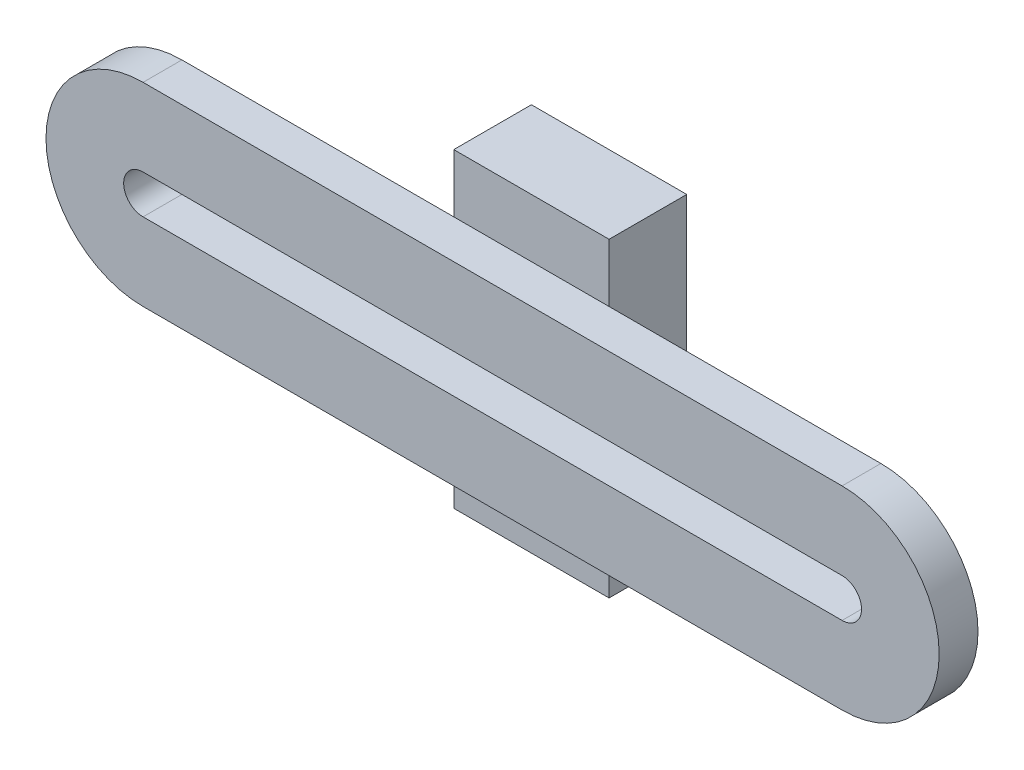
ISO-10303-21;
HEADER;
FILE_DESCRIPTION(('STEP AP214'),'2;1');
FILE_NAME('part.step','',(''),(''),'','','');
FILE_SCHEMA(('AUTOMOTIVE_DESIGN { 1 0 10303 214 1 1 1 1 }'));
ENDSEC;
DATA;
#1=APPLICATION_CONTEXT('core data for automotive mechanical design processes');
#2=APPLICATION_PROTOCOL_DEFINITION('international standard','automotive_design',2000,#1);
#3=PRODUCT_CONTEXT('',#1,'mechanical');
#4=PRODUCT('Part','Part','',(#3));
#5=PRODUCT_RELATED_PRODUCT_CATEGORY('part','',(#4));
#6=PRODUCT_DEFINITION_FORMATION('','',#4);
#7=PRODUCT_DEFINITION_CONTEXT('part definition',#1,'design');
#8=PRODUCT_DEFINITION('design','',#6,#7);
#9=PRODUCT_DEFINITION_SHAPE('','',#8);
#10=(LENGTH_UNIT() NAMED_UNIT(*) SI_UNIT(.MILLI.,.METRE.));
#11=(NAMED_UNIT(*) PLANE_ANGLE_UNIT() SI_UNIT($,.RADIAN.));
#12=(NAMED_UNIT(*) SI_UNIT($,.STERADIAN.) SOLID_ANGLE_UNIT());
#13=UNCERTAINTY_MEASURE_WITH_UNIT(LENGTH_MEASURE(1.E-05),#10,'distance_accuracy_value','');
#14=(GEOMETRIC_REPRESENTATION_CONTEXT(3) GLOBAL_UNCERTAINTY_ASSIGNED_CONTEXT((#13)) GLOBAL_UNIT_ASSIGNED_CONTEXT((#10,
#11,#12)) REPRESENTATION_CONTEXT('',''));
#15=CARTESIAN_POINT('',(0.,0.,0.));
#16=DIRECTION('',(0.,0.,1.));
#17=DIRECTION('',(1.,0.,0.));
#18=AXIS2_PLACEMENT_3D('',#15,#16,#17);
#19=CARTESIAN_POINT('',(0.,0.,0.));
#20=DIRECTION('',(0.,0.,-1.));
#21=DIRECTION('',(-1.,0.,0.));
#22=AXIS2_PLACEMENT_3D('',#19,#20,#21);
#23=PLANE('',#22);
#24=DIRECTION('',(-1.,0.,0.));
#25=VECTOR('',#24,1.);
#26=CARTESIAN_POINT('',(-57.1499999999995,-45.3307191163703,0.));
#27=LINE('',#26,#25);
#28=CARTESIAN_POINT('',(12.6999999999999,-45.3307191163703,0.));
#29=VERTEX_POINT('',#28);
#30=CARTESIAN_POINT('',(-12.6999999999999,-45.3307191163703,0.));
#31=VERTEX_POINT('',#30);
#32=EDGE_CURVE('E11',#29,#31,#27,.T.);
#33=ORIENTED_EDGE('',*,*,#32,.F.);
#34=DIRECTION('',(0.,1.,0.));
#35=VECTOR('',#34,1.);
#36=CARTESIAN_POINT('',(12.6999999999999,-86.6057191163703,0.));
#37=LINE('',#36,#35);
#38=CARTESIAN_POINT('',(12.6999999999999,-35.8057191163703,0.));
#39=VERTEX_POINT('',#38);
#40=EDGE_CURVE('E256',#29,#39,#37,.T.);
#41=ORIENTED_EDGE('',*,*,#40,.T.);
#42=DIRECTION('',(-1.,0.,0.));
#43=VECTOR('',#42,1.);
#44=CARTESIAN_POINT('',(-12.6999999999999,-35.8057191163703,0.));
#45=LINE('',#44,#43);
#46=CARTESIAN_POINT('',(-12.6999999999999,-35.8057191163703,0.));
#47=VERTEX_POINT('',#46);
#48=EDGE_CURVE('E249',#39,#47,#45,.T.);
#49=ORIENTED_EDGE('',*,*,#48,.T.);
#50=DIRECTION('',(0.,-1.,0.));
#51=VECTOR('',#50,1.);
#52=CARTESIAN_POINT('',(-12.6999999999999,-86.6057191163703,0.));
#53=LINE('',#52,#51);
#54=EDGE_CURVE('E244',#47,#31,#53,.T.);
#55=ORIENTED_EDGE('',*,*,#54,.T.);
#56=EDGE_LOOP('',(#33,#41,#49,#55));
#57=FACE_BOUND('',#56,.T.);
#58=ADVANCED_FACE('F34',(#57),#23,.F.);
#59=DIRECTION('',(1.,0.,0.));
#60=VECTOR('',#59,1.);
#61=CARTESIAN_POINT('',(-57.1499999999995,-77.0807191163703,0.));
#62=LINE('',#61,#60);
#63=CARTESIAN_POINT('',(-12.6999999999999,-77.0807191163703,0.));
#64=VERTEX_POINT('',#63);
#65=CARTESIAN_POINT('',(12.6999999999999,-77.0807191163703,0.));
#66=VERTEX_POINT('',#65);
#67=EDGE_CURVE('E43',#64,#66,#62,.T.);
#68=ORIENTED_EDGE('',*,*,#67,.F.);
#69=CARTESIAN_POINT('',(-12.6999999999999,-86.6057191163703,0.));
#70=VERTEX_POINT('',#69);
#71=EDGE_CURVE('E248',#64,#70,#53,.T.);
#72=ORIENTED_EDGE('',*,*,#71,.T.);
#73=DIRECTION('',(1.,0.,0.));
#74=VECTOR('',#73,1.);
#75=CARTESIAN_POINT('',(-12.6999999999999,-86.6057191163703,0.));
#76=LINE('',#75,#74);
#77=CARTESIAN_POINT('',(12.6999999999999,-86.6057191163703,0.));
#78=VERTEX_POINT('',#77);
#79=EDGE_CURVE('E240',#70,#78,#76,.T.);
#80=ORIENTED_EDGE('',*,*,#79,.T.);
#81=EDGE_CURVE('E252',#78,#66,#37,.T.);
#82=ORIENTED_EDGE('',*,*,#81,.T.);
#83=EDGE_LOOP('',(#68,#72,#80,#82));
#84=FACE_BOUND('',#83,.T.);
#85=ADVANCED_FACE('F342',(#84),#23,.F.);
#86=CARTESIAN_POINT('',(-12.6999999999999,-58.0307191163703,0.));
#87=VERTEX_POINT('',#86);
#88=CARTESIAN_POINT('',(-12.6999999999999,-64.3807191163703,0.));
#89=VERTEX_POINT('',#88);
#90=EDGE_CURVE('E300',#87,#89,#53,.T.);
#91=ORIENTED_EDGE('',*,*,#90,.T.);
#92=DIRECTION('',(1.,0.,0.));
#93=VECTOR('',#92,1.);
#94=CARTESIAN_POINT('',(-57.1499999999995,-64.3807191163703,0.));
#95=LINE('',#94,#93);
#96=CARTESIAN_POINT('',(-5.4992613140312,-64.3807191163703,0.));
#97=VERTEX_POINT('',#96);
#98=EDGE_CURVE('E299',#89,#97,#95,.T.);
#99=ORIENTED_EDGE('',*,*,#98,.T.);
#100=CARTESIAN_POINT('',(0.,-61.2057191163703,0.));
#101=DIRECTION('',(0.,0.,1.));
#102=DIRECTION('',(1.,0.,0.));
#103=AXIS2_PLACEMENT_3D('',#100,#101,#102);
#104=CIRCLE('',#103,6.35);
#105=CARTESIAN_POINT('',(-5.49926131403118,-58.0307191163703,0.));
#106=VERTEX_POINT('',#105);
#107=EDGE_CURVE('E260',#106,#97,#104,.T.);
#108=ORIENTED_EDGE('',*,*,#107,.F.);
#109=DIRECTION('',(-1.,0.,0.));
#110=VECTOR('',#109,1.);
#111=CARTESIAN_POINT('',(-57.1499999999995,-58.0307191163703,0.));
#112=LINE('',#111,#110);
#113=EDGE_CURVE('E204',#106,#87,#112,.T.);
#114=ORIENTED_EDGE('',*,*,#113,.T.);
#115=EDGE_LOOP('',(#91,#99,#108,#114));
#116=FACE_BOUND('',#115,.T.);
#117=ADVANCED_FACE('F297',(#116),#23,.F.);
#118=CARTESIAN_POINT('',(12.6999999999999,-86.6057191163703,-69.4961266284946));
#119=DIRECTION('',(1.,0.,0.));
#120=DIRECTION('',(0.,0.,-1.));
#121=AXIS2_PLACEMENT_3D('',#118,#119,#120);
#122=PLANE('',#121);
#123=DIRECTION('',(0.,0.,1.));
#124=VECTOR('',#123,1.);
#125=CARTESIAN_POINT('',(12.6999999999999,-86.6057191163703,-69.4961266284946));
#126=LINE('',#125,#124);
#127=CARTESIAN_POINT('',(12.6999999999999,-86.6057191163703,-12.7));
#128=VERTEX_POINT('',#127);
#129=EDGE_CURVE('E274',#128,#78,#126,.T.);
#130=ORIENTED_EDGE('',*,*,#129,.F.);
#131=DIRECTION('',(0.,1.,0.));
#132=VECTOR('',#131,1.);
#133=CARTESIAN_POINT('',(12.6999999999999,-86.6057191163703,-12.7));
#134=LINE('',#133,#132);
#135=CARTESIAN_POINT('',(12.6999999999999,-35.8057191163703,-12.7));
#136=VERTEX_POINT('',#135);
#137=EDGE_CURVE('E239',#128,#136,#134,.T.);
#138=ORIENTED_EDGE('',*,*,#137,.T.);
#139=DIRECTION('',(0.,0.,1.));
#140=VECTOR('',#139,1.);
#141=CARTESIAN_POINT('',(12.6999999999999,-35.8057191163703,-69.4961266284946));
#142=LINE('',#141,#140);
#143=EDGE_CURVE('E38',#136,#39,#142,.T.);
#144=ORIENTED_EDGE('',*,*,#143,.T.);
#145=ORIENTED_EDGE('',*,*,#40,.F.);
#146=CARTESIAN_POINT('',(12.6999999999999,-58.0307191163703,0.));
#147=VERTEX_POINT('',#146);
#148=EDGE_CURVE('E319',#147,#29,#37,.T.);
#149=ORIENTED_EDGE('',*,*,#148,.F.);
#150=CARTESIAN_POINT('',(12.6999999999999,-64.3807191163703,0.));
#151=VERTEX_POINT('',#150);
#152=EDGE_CURVE('E326',#151,#147,#37,.T.);
#153=ORIENTED_EDGE('',*,*,#152,.F.);
#154=EDGE_CURVE('E255',#66,#151,#37,.T.);
#155=ORIENTED_EDGE('',*,*,#154,.F.);
#156=ORIENTED_EDGE('',*,*,#81,.F.);
#157=EDGE_LOOP('',(#130,#138,#144,#145,#149,#153,#155,#156));
#158=FACE_BOUND('',#157,.T.);
#159=ADVANCED_FACE('F325',(#158),#122,.T.);
#160=CARTESIAN_POINT('',(-12.6999999999999,-86.6057191163703,-69.4961266284946));
#161=DIRECTION('',(0.,-1.,0.));
#162=DIRECTION('',(0.,0.,-1.));
#163=AXIS2_PLACEMENT_3D('',#160,#161,#162);
#164=PLANE('',#163);
#165=DIRECTION('',(0.,0.,1.));
#166=VECTOR('',#165,1.);
#167=CARTESIAN_POINT('',(-12.6999999999999,-86.6057191163703,-69.4961266284946));
#168=LINE('',#167,#166);
#169=CARTESIAN_POINT('',(-12.6999999999999,-86.6057191163703,-12.7));
#170=VERTEX_POINT('',#169);
#171=EDGE_CURVE('E268',#170,#70,#168,.T.);
#172=ORIENTED_EDGE('',*,*,#171,.F.);
#173=DIRECTION('',(1.,0.,0.));
#174=VECTOR('',#173,1.);
#175=CARTESIAN_POINT('',(-12.6999999999999,-86.6057191163703,-12.7));
#176=LINE('',#175,#174);
#177=EDGE_CURVE('E271',#170,#128,#176,.T.);
#178=ORIENTED_EDGE('',*,*,#177,.T.);
#179=ORIENTED_EDGE('',*,*,#129,.T.);
#180=ORIENTED_EDGE('',*,*,#79,.F.);
#181=EDGE_LOOP('',(#172,#178,#179,#180));
#182=FACE_BOUND('',#181,.T.);
#183=ADVANCED_FACE('F347',(#182),#164,.T.);
#184=CARTESIAN_POINT('',(-12.6999999999999,-86.6057191163703,-69.4961266284946));
#185=DIRECTION('',(-1.,0.,0.));
#186=DIRECTION('',(0.,0.,1.));
#187=AXIS2_PLACEMENT_3D('',#184,#185,#186);
#188=PLANE('',#187);
#189=DIRECTION('',(0.,0.,1.));
#190=VECTOR('',#189,1.);
#191=CARTESIAN_POINT('',(-12.6999999999999,-35.8057191163703,-69.4961266284946));
#192=LINE('',#191,#190);
#193=CARTESIAN_POINT('',(-12.6999999999999,-35.8057191163703,-12.7));
#194=VERTEX_POINT('',#193);
#195=EDGE_CURVE('E267',#194,#47,#192,.T.);
#196=ORIENTED_EDGE('',*,*,#195,.F.);
#197=DIRECTION('',(0.,-1.,0.));
#198=VECTOR('',#197,1.);
#199=CARTESIAN_POINT('',(-12.6999999999999,-86.6057191163703,-12.7));
#200=LINE('',#199,#198);
#201=EDGE_CURVE('E275',#194,#170,#200,.T.);
#202=ORIENTED_EDGE('',*,*,#201,.T.);
#203=ORIENTED_EDGE('',*,*,#171,.T.);
#204=ORIENTED_EDGE('',*,*,#71,.F.);
#205=EDGE_CURVE('E337',#89,#64,#53,.T.);
#206=ORIENTED_EDGE('',*,*,#205,.F.);
#207=ORIENTED_EDGE('',*,*,#90,.F.);
#208=EDGE_CURVE('E247',#31,#87,#53,.T.);
#209=ORIENTED_EDGE('',*,*,#208,.F.);
#210=ORIENTED_EDGE('',*,*,#54,.F.);
#211=EDGE_LOOP('',(#196,#202,#203,#204,#206,#207,#209,#210));
#212=FACE_BOUND('',#211,.T.);
#213=ADVANCED_FACE('F345',(#212),#188,.T.);
#214=CARTESIAN_POINT('',(-12.6999999999999,-35.8057191163703,-69.4961266284946));
#215=DIRECTION('',(0.,1.,0.));
#216=DIRECTION('',(0.,0.,1.));
#217=AXIS2_PLACEMENT_3D('',#214,#215,#216);
#218=PLANE('',#217);
#219=ORIENTED_EDGE('',*,*,#143,.F.);
#220=DIRECTION('',(-1.,0.,0.));
#221=VECTOR('',#220,1.);
#222=CARTESIAN_POINT('',(-12.6999999999999,-35.8057191163703,-12.7));
#223=LINE('',#222,#221);
#224=EDGE_CURVE('E264',#136,#194,#223,.T.);
#225=ORIENTED_EDGE('',*,*,#224,.T.);
#226=ORIENTED_EDGE('',*,*,#195,.T.);
#227=ORIENTED_EDGE('',*,*,#48,.F.);
#228=EDGE_LOOP('',(#219,#225,#226,#227));
#229=FACE_BOUND('',#228,.T.);
#230=ADVANCED_FACE('F351',(#229),#218,.T.);
#231=CARTESIAN_POINT('',(0.,-61.2057191163703,-69.4961266284946));
#232=DIRECTION('',(0.,0.,1.));
#233=DIRECTION('',(1.,0.,0.));
#234=AXIS2_PLACEMENT_3D('',#231,#232,#233);
#235=CYLINDRICAL_SURFACE('',#234,6.35);
#236=CARTESIAN_POINT('',(5.49926131403118,-58.0307191163703,0.));
#237=VERTEX_POINT('',#236);
#238=EDGE_CURVE('E257',#237,#106,#104,.T.);
#239=ORIENTED_EDGE('',*,*,#238,.T.);
#240=ORIENTED_EDGE('',*,*,#107,.T.);
#241=CARTESIAN_POINT('',(5.4992613140312,-64.3807191163703,0.));
#242=VERTEX_POINT('',#241);
#243=EDGE_CURVE('E285',#97,#242,#104,.T.);
#244=ORIENTED_EDGE('',*,*,#243,.T.);
#245=EDGE_CURVE('E261',#242,#237,#104,.T.);
#246=ORIENTED_EDGE('',*,*,#245,.T.);
#247=EDGE_LOOP('',(#239,#240,#244,#246));
#248=FACE_BOUND('',#247,.T.);
#249=CARTESIAN_POINT('',(0.,-61.2057191163703,-12.7));
#250=DIRECTION('',(0.,0.,-1.));
#251=DIRECTION('',(-1.,0.,0.));
#252=AXIS2_PLACEMENT_3D('',#249,#250,#251);
#253=CIRCLE('',#252,6.35);
#254=CARTESIAN_POINT('',(-6.35,-61.2057191163703,-12.7));
#255=VERTEX_POINT('',#254);
#256=EDGE_CURVE('E243',#255,#255,#253,.F.);
#257=ORIENTED_EDGE('',*,*,#256,.F.);
#258=EDGE_LOOP('',(#257));
#259=FACE_BOUND('',#258,.T.);
#260=ADVANCED_FACE('F291',(#248,#259),#235,.F.);
#261=ORIENTED_EDGE('',*,*,#245,.F.);
#262=EDGE_CURVE('E198',#242,#151,#95,.T.);
#263=ORIENTED_EDGE('',*,*,#262,.T.);
#264=ORIENTED_EDGE('',*,*,#152,.T.);
#265=EDGE_CURVE('E304',#147,#237,#112,.T.);
#266=ORIENTED_EDGE('',*,*,#265,.T.);
#267=EDGE_LOOP('',(#261,#263,#264,#266));
#268=FACE_BOUND('',#267,.T.);
#269=ADVANCED_FACE('F329',(#268),#23,.F.);
#270=CARTESIAN_POINT('',(0.,-1.22124532708767E-12,-12.7));
#271=DIRECTION('',(0.,0.,-1.));
#272=DIRECTION('',(-1.,0.,0.));
#273=AXIS2_PLACEMENT_3D('',#270,#271,#272);
#274=PLANE('',#273);
#275=ORIENTED_EDGE('',*,*,#137,.F.);
#276=ORIENTED_EDGE('',*,*,#177,.F.);
#277=ORIENTED_EDGE('',*,*,#201,.F.);
#278=ORIENTED_EDGE('',*,*,#224,.F.);
#279=EDGE_LOOP('',(#275,#276,#277,#278));
#280=FACE_BOUND('',#279,.T.);
#281=ORIENTED_EDGE('',*,*,#256,.T.);
#282=EDGE_LOOP('',(#281));
#283=FACE_BOUND('',#282,.T.);
#284=ADVANCED_FACE('F36',(#280,#283),#274,.T.);
#285=CARTESIAN_POINT('',(-57.15,-61.2057191163703,0.));
#286=DIRECTION('',(0.,0.,1.));
#287=DIRECTION('',(1.,0.,0.));
#288=AXIS2_PLACEMENT_3D('',#285,#286,#287);
#289=PLANE('',#288);
#290=CARTESIAN_POINT('',(57.1499999999995,-77.0807191163703,0.));
#291=VERTEX_POINT('',#290);
#292=EDGE_CURVE('E221',#66,#291,#62,.T.);
#293=ORIENTED_EDGE('',*,*,#292,.F.);
#294=ORIENTED_EDGE('',*,*,#154,.T.);
#295=CARTESIAN_POINT('',(57.1499999999995,-64.3807191163703,0.));
#296=VERTEX_POINT('',#295);
#297=EDGE_CURVE('E61',#151,#296,#95,.T.);
#298=ORIENTED_EDGE('',*,*,#297,.T.);
#299=CARTESIAN_POINT('',(57.15,-61.2057191163703,0.));
#300=DIRECTION('',(0.,0.,1.));
#301=DIRECTION('',(1.,0.,0.));
#302=AXIS2_PLACEMENT_3D('',#299,#300,#301);
#303=CIRCLE('',#302,3.175);
#304=CARTESIAN_POINT('',(57.1499999999995,-58.0307191163703,0.));
#305=VERTEX_POINT('',#304);
#306=EDGE_CURVE('E196',#296,#305,#303,.T.);
#307=ORIENTED_EDGE('',*,*,#306,.T.);
#308=EDGE_CURVE('E175',#305,#147,#112,.T.);
#309=ORIENTED_EDGE('',*,*,#308,.T.);
#310=ORIENTED_EDGE('',*,*,#148,.T.);
#311=CARTESIAN_POINT('',(57.1499999999995,-45.3307191163703,0.));
#312=VERTEX_POINT('',#311);
#313=EDGE_CURVE('E45',#312,#29,#27,.T.);
#314=ORIENTED_EDGE('',*,*,#313,.F.);
#315=CARTESIAN_POINT('',(57.15,-61.2057191163703,0.));
#316=DIRECTION('',(0.,0.,1.));
#317=DIRECTION('',(1.,0.,0.));
#318=AXIS2_PLACEMENT_3D('',#315,#316,#317);
#319=CIRCLE('',#318,15.875);
#320=EDGE_CURVE('E225',#291,#312,#319,.T.);
#321=ORIENTED_EDGE('',*,*,#320,.F.);
#322=EDGE_LOOP('',(#293,#294,#298,#307,#309,#310,#314,#321));
#323=FACE_BOUND('',#322,.T.);
#324=ADVANCED_FACE('F308',(#323),#289,.F.);
#325=ORIENTED_EDGE('',*,*,#243,.F.);
#326=EDGE_CURVE('E197',#97,#242,#95,.T.);
#327=ORIENTED_EDGE('',*,*,#326,.T.);
#328=EDGE_LOOP('',(#325,#327));
#329=FACE_BOUND('',#328,.T.);
#330=ADVANCED_FACE('F379',(#329),#289,.F.);
#331=CARTESIAN_POINT('',(-57.1499999999995,-45.3307191163703,0.));
#332=VERTEX_POINT('',#331);
#333=EDGE_CURVE('E46',#31,#332,#27,.T.);
#334=ORIENTED_EDGE('',*,*,#333,.F.);
#335=ORIENTED_EDGE('',*,*,#208,.T.);
#336=CARTESIAN_POINT('',(-57.1499999999995,-58.0307191163703,0.));
#337=VERTEX_POINT('',#336);
#338=EDGE_CURVE('E53',#87,#337,#112,.T.);
#339=ORIENTED_EDGE('',*,*,#338,.T.);
#340=CARTESIAN_POINT('',(-57.15,-61.2057191163703,0.));
#341=DIRECTION('',(0.,0.,1.));
#342=DIRECTION('',(1.,0.,0.));
#343=AXIS2_PLACEMENT_3D('',#340,#341,#342);
#344=CIRCLE('',#343,3.175);
#345=CARTESIAN_POINT('',(-57.1499999999995,-64.3807191163703,0.));
#346=VERTEX_POINT('',#345);
#347=EDGE_CURVE('E193',#337,#346,#344,.T.);
#348=ORIENTED_EDGE('',*,*,#347,.T.);
#349=EDGE_CURVE('E180',#346,#89,#95,.T.);
#350=ORIENTED_EDGE('',*,*,#349,.T.);
#351=ORIENTED_EDGE('',*,*,#205,.T.);
#352=CARTESIAN_POINT('',(-57.1499999999995,-77.0807191163703,0.));
#353=VERTEX_POINT('',#352);
#354=EDGE_CURVE('E222',#353,#64,#62,.T.);
#355=ORIENTED_EDGE('',*,*,#354,.F.);
#356=CARTESIAN_POINT('',(-57.15,-61.2057191163703,0.));
#357=DIRECTION('',(0.,0.,1.));
#358=DIRECTION('',(1.,0.,0.));
#359=AXIS2_PLACEMENT_3D('',#356,#357,#358);
#360=CIRCLE('',#359,15.875);
#361=EDGE_CURVE('E181',#332,#353,#360,.T.);
#362=ORIENTED_EDGE('',*,*,#361,.F.);
#363=EDGE_LOOP('',(#334,#335,#339,#348,#350,#351,#355,#362));
#364=FACE_BOUND('',#363,.T.);
#365=ADVANCED_FACE('F333',(#364),#289,.F.);
#366=CARTESIAN_POINT('',(-57.15,-61.2057191163703,6.35));
#367=DIRECTION('',(0.,0.,1.));
#368=DIRECTION('',(1.,0.,0.));
#369=AXIS2_PLACEMENT_3D('',#366,#367,#368);
#370=PLANE('',#369);
#371=CARTESIAN_POINT('',(-57.15,-61.2057191163703,6.35));
#372=DIRECTION('',(0.,0.,1.));
#373=DIRECTION('',(1.,0.,0.));
#374=AXIS2_PLACEMENT_3D('',#371,#372,#373);
#375=CIRCLE('',#374,15.875);
#376=CARTESIAN_POINT('',(-57.1499999999995,-45.3307191163703,6.35));
#377=VERTEX_POINT('',#376);
#378=CARTESIAN_POINT('',(-57.1499999999995,-77.0807191163703,6.35));
#379=VERTEX_POINT('',#378);
#380=EDGE_CURVE('E209',#377,#379,#375,.T.);
#381=ORIENTED_EDGE('',*,*,#380,.T.);
#382=DIRECTION('',(1.,0.,0.));
#383=VECTOR('',#382,1.);
#384=CARTESIAN_POINT('',(-57.1499999999995,-77.0807191163703,6.35));
#385=LINE('',#384,#383);
#386=CARTESIAN_POINT('',(57.1499999999995,-77.0807191163703,6.35));
#387=VERTEX_POINT('',#386);
#388=EDGE_CURVE('E212',#379,#387,#385,.T.);
#389=ORIENTED_EDGE('',*,*,#388,.T.);
#390=CARTESIAN_POINT('',(57.15,-61.2057191163703,6.35));
#391=DIRECTION('',(0.,0.,1.));
#392=DIRECTION('',(1.,0.,0.));
#393=AXIS2_PLACEMENT_3D('',#390,#391,#392);
#394=CIRCLE('',#393,15.875);
#395=CARTESIAN_POINT('',(57.1499999999995,-45.3307191163703,6.35));
#396=VERTEX_POINT('',#395);
#397=EDGE_CURVE('E214',#387,#396,#394,.T.);
#398=ORIENTED_EDGE('',*,*,#397,.T.);
#399=DIRECTION('',(-1.,0.,0.));
#400=VECTOR('',#399,1.);
#401=CARTESIAN_POINT('',(-57.1499999999995,-45.3307191163703,6.35));
#402=LINE('',#401,#400);
#403=EDGE_CURVE('E216',#396,#377,#402,.T.);
#404=ORIENTED_EDGE('',*,*,#403,.T.);
#405=EDGE_LOOP('',(#381,#389,#398,#404));
#406=FACE_BOUND('',#405,.T.);
#407=DIRECTION('',(1.,0.,0.));
#408=VECTOR('',#407,1.);
#409=CARTESIAN_POINT('',(-57.1499999999995,-64.3807191163703,6.35));
#410=LINE('',#409,#408);
#411=CARTESIAN_POINT('',(-57.1499999999995,-64.3807191163703,6.35));
#412=VERTEX_POINT('',#411);
#413=CARTESIAN_POINT('',(57.1499999999995,-64.3807191163703,6.35));
#414=VERTEX_POINT('',#413);
#415=EDGE_CURVE('E174',#412,#414,#410,.T.);
#416=ORIENTED_EDGE('',*,*,#415,.F.);
#417=CARTESIAN_POINT('',(-57.15,-61.2057191163703,6.35));
#418=DIRECTION('',(0.,0.,1.));
#419=DIRECTION('',(1.,0.,0.));
#420=AXIS2_PLACEMENT_3D('',#417,#418,#419);
#421=CIRCLE('',#420,3.175);
#422=CARTESIAN_POINT('',(-57.1499999999995,-58.0307191163703,6.35));
#423=VERTEX_POINT('',#422);
#424=EDGE_CURVE('E164',#423,#412,#421,.T.);
#425=ORIENTED_EDGE('',*,*,#424,.F.);
#426=DIRECTION('',(-1.,0.,0.));
#427=VECTOR('',#426,1.);
#428=CARTESIAN_POINT('',(-57.1499999999995,-58.0307191163703,6.35));
#429=LINE('',#428,#427);
#430=CARTESIAN_POINT('',(57.1499999999995,-58.0307191163703,6.35));
#431=VERTEX_POINT('',#430);
#432=EDGE_CURVE('E189',#431,#423,#429,.T.);
#433=ORIENTED_EDGE('',*,*,#432,.F.);
#434=CARTESIAN_POINT('',(57.15,-61.2057191163703,6.35));
#435=DIRECTION('',(0.,0.,1.));
#436=DIRECTION('',(1.,0.,0.));
#437=AXIS2_PLACEMENT_3D('',#434,#435,#436);
#438=CIRCLE('',#437,3.175);
#439=EDGE_CURVE('E187',#414,#431,#438,.T.);
#440=ORIENTED_EDGE('',*,*,#439,.F.);
#441=EDGE_LOOP('',(#416,#425,#433,#440));
#442=FACE_BOUND('',#441,.T.);
#443=ADVANCED_FACE('F185',(#406,#442),#370,.T.);
#444=ORIENTED_EDGE('',*,*,#238,.F.);
#445=EDGE_CURVE('E203',#237,#106,#112,.T.);
#446=ORIENTED_EDGE('',*,*,#445,.T.);
#447=EDGE_LOOP('',(#444,#446));
#448=FACE_BOUND('',#447,.T.);
#449=ADVANCED_FACE('F372',(#448),#289,.F.);
#450=CARTESIAN_POINT('',(-57.15,-61.2057191163703,6.35));
#451=DIRECTION('',(0.,0.,-1.));
#452=DIRECTION('',(-1.,0.,0.));
#453=AXIS2_PLACEMENT_3D('',#450,#451,#452);
#454=CYLINDRICAL_SURFACE('',#453,15.875);
#455=ORIENTED_EDGE('',*,*,#361,.T.);
#456=DIRECTION('',(0.,0.,-1.));
#457=VECTOR('',#456,1.);
#458=CARTESIAN_POINT('',(-57.1499999999995,-77.0807191163703,6.35));
#459=LINE('',#458,#457);
#460=EDGE_CURVE('E236',#379,#353,#459,.T.);
#461=ORIENTED_EDGE('',*,*,#460,.F.);
#462=ORIENTED_EDGE('',*,*,#380,.F.);
#463=DIRECTION('',(0.,0.,-1.));
#464=VECTOR('',#463,1.);
#465=CARTESIAN_POINT('',(-57.1499999999995,-45.3307191163703,6.35));
#466=LINE('',#465,#464);
#467=EDGE_CURVE('E218',#377,#332,#466,.T.);
#468=ORIENTED_EDGE('',*,*,#467,.T.);
#469=EDGE_LOOP('',(#455,#461,#462,#468));
#470=FACE_BOUND('',#469,.T.);
#471=ADVANCED_FACE('F368',(#470),#454,.T.);
#472=CARTESIAN_POINT('',(-57.1499999999995,-77.0807191163703,6.35));
#473=DIRECTION('',(0.,1.,0.));
#474=DIRECTION('',(-1.,0.,0.));
#475=AXIS2_PLACEMENT_3D('',#472,#473,#474);
#476=PLANE('',#475);
#477=ORIENTED_EDGE('',*,*,#354,.T.);
#478=ORIENTED_EDGE('',*,*,#67,.T.);
#479=ORIENTED_EDGE('',*,*,#292,.T.);
#480=DIRECTION('',(0.,0.,-1.));
#481=VECTOR('',#480,1.);
#482=CARTESIAN_POINT('',(57.1499999999995,-77.0807191163703,6.35));
#483=LINE('',#482,#481);
#484=EDGE_CURVE('E233',#387,#291,#483,.T.);
#485=ORIENTED_EDGE('',*,*,#484,.F.);
#486=ORIENTED_EDGE('',*,*,#388,.F.);
#487=ORIENTED_EDGE('',*,*,#460,.T.);
#488=EDGE_LOOP('',(#477,#478,#479,#485,#486,#487));
#489=FACE_BOUND('',#488,.T.);
#490=ADVANCED_FACE('F365',(#489),#476,.F.);
#491=CARTESIAN_POINT('',(57.15,-61.2057191163703,6.35));
#492=DIRECTION('',(0.,0.,-1.));
#493=DIRECTION('',(-1.,0.,0.));
#494=AXIS2_PLACEMENT_3D('',#491,#492,#493);
#495=CYLINDRICAL_SURFACE('',#494,15.875);
#496=ORIENTED_EDGE('',*,*,#320,.T.);
#497=DIRECTION('',(0.,0.,-1.));
#498=VECTOR('',#497,1.);
#499=CARTESIAN_POINT('',(57.1499999999995,-45.3307191163703,6.35));
#500=LINE('',#499,#498);
#501=EDGE_CURVE('E230',#396,#312,#500,.T.);
#502=ORIENTED_EDGE('',*,*,#501,.F.);
#503=ORIENTED_EDGE('',*,*,#397,.F.);
#504=ORIENTED_EDGE('',*,*,#484,.T.);
#505=EDGE_LOOP('',(#496,#502,#503,#504));
#506=FACE_BOUND('',#505,.T.);
#507=ADVANCED_FACE('F361',(#506),#495,.T.);
#508=CARTESIAN_POINT('',(-57.1499999999995,-45.3307191163703,6.35));
#509=DIRECTION('',(0.,-1.,0.));
#510=DIRECTION('',(0.,0.,-1.));
#511=AXIS2_PLACEMENT_3D('',#508,#509,#510);
#512=PLANE('',#511);
#513=ORIENTED_EDGE('',*,*,#313,.T.);
#514=ORIENTED_EDGE('',*,*,#32,.T.);
#515=ORIENTED_EDGE('',*,*,#333,.T.);
#516=ORIENTED_EDGE('',*,*,#467,.F.);
#517=ORIENTED_EDGE('',*,*,#403,.F.);
#518=ORIENTED_EDGE('',*,*,#501,.T.);
#519=EDGE_LOOP('',(#513,#514,#515,#516,#517,#518));
#520=FACE_BOUND('',#519,.T.);
#521=ADVANCED_FACE('F355',(#520),#512,.F.);
#522=CARTESIAN_POINT('',(-57.15,-61.2057191163703,6.35));
#523=DIRECTION('',(0.,0.,-1.));
#524=DIRECTION('',(-1.,0.,0.));
#525=AXIS2_PLACEMENT_3D('',#522,#523,#524);
#526=CYLINDRICAL_SURFACE('',#525,3.175);
#527=ORIENTED_EDGE('',*,*,#347,.F.);
#528=DIRECTION('',(0.,0.,-1.));
#529=VECTOR('',#528,1.);
#530=CARTESIAN_POINT('',(-57.1499999999995,-58.0307191163703,6.35));
#531=LINE('',#530,#529);
#532=EDGE_CURVE('E170',#423,#337,#531,.T.);
#533=ORIENTED_EDGE('',*,*,#532,.F.);
#534=ORIENTED_EDGE('',*,*,#424,.T.);
#535=DIRECTION('',(0.,0.,-1.));
#536=VECTOR('',#535,1.);
#537=CARTESIAN_POINT('',(-57.1499999999995,-64.3807191163703,6.35));
#538=LINE('',#537,#536);
#539=EDGE_CURVE('E168',#412,#346,#538,.T.);
#540=ORIENTED_EDGE('',*,*,#539,.T.);
#541=EDGE_LOOP('',(#527,#533,#534,#540));
#542=FACE_BOUND('',#541,.T.);
#543=ADVANCED_FACE('F167',(#542),#526,.F.);
#544=CARTESIAN_POINT('',(-57.1499999999995,-64.3807191163703,6.35));
#545=DIRECTION('',(0.,1.,0.));
#546=DIRECTION('',(-1.,0.,0.));
#547=AXIS2_PLACEMENT_3D('',#544,#545,#546);
#548=PLANE('',#547);
#549=ORIENTED_EDGE('',*,*,#349,.F.);
#550=ORIENTED_EDGE('',*,*,#539,.F.);
#551=ORIENTED_EDGE('',*,*,#415,.T.);
#552=DIRECTION('',(0.,0.,-1.));
#553=VECTOR('',#552,1.);
#554=CARTESIAN_POINT('',(57.1499999999995,-64.3807191163703,6.35));
#555=LINE('',#554,#553);
#556=EDGE_CURVE('E182',#414,#296,#555,.T.);
#557=ORIENTED_EDGE('',*,*,#556,.T.);
#558=ORIENTED_EDGE('',*,*,#297,.F.);
#559=ORIENTED_EDGE('',*,*,#262,.F.);
#560=ORIENTED_EDGE('',*,*,#326,.F.);
#561=ORIENTED_EDGE('',*,*,#98,.F.);
#562=EDGE_LOOP('',(#549,#550,#551,#557,#558,#559,#560,#561));
#563=FACE_BOUND('',#562,.T.);
#564=ADVANCED_FACE('F177',(#563),#548,.T.);
#565=CARTESIAN_POINT('',(57.15,-61.2057191163703,6.35));
#566=DIRECTION('',(0.,0.,-1.));
#567=DIRECTION('',(-1.,0.,0.));
#568=AXIS2_PLACEMENT_3D('',#565,#566,#567);
#569=CYLINDRICAL_SURFACE('',#568,3.175);
#570=ORIENTED_EDGE('',*,*,#306,.F.);
#571=ORIENTED_EDGE('',*,*,#556,.F.);
#572=ORIENTED_EDGE('',*,*,#439,.T.);
#573=DIRECTION('',(0.,0.,-1.));
#574=VECTOR('',#573,1.);
#575=CARTESIAN_POINT('',(57.1499999999995,-58.0307191163703,6.35));
#576=LINE('',#575,#574);
#577=EDGE_CURVE('E206',#431,#305,#576,.T.);
#578=ORIENTED_EDGE('',*,*,#577,.T.);
#579=EDGE_LOOP('',(#570,#571,#572,#578));
#580=FACE_BOUND('',#579,.T.);
#581=ADVANCED_FACE('F312',(#580),#569,.F.);
#582=CARTESIAN_POINT('',(-57.1499999999995,-58.0307191163703,6.35));
#583=DIRECTION('',(0.,-1.,0.));
#584=DIRECTION('',(1.,0.,0.));
#585=AXIS2_PLACEMENT_3D('',#582,#583,#584);
#586=PLANE('',#585);
#587=ORIENTED_EDGE('',*,*,#308,.F.);
#588=ORIENTED_EDGE('',*,*,#577,.F.);
#589=ORIENTED_EDGE('',*,*,#432,.T.);
#590=ORIENTED_EDGE('',*,*,#532,.T.);
#591=ORIENTED_EDGE('',*,*,#338,.F.);
#592=ORIENTED_EDGE('',*,*,#113,.F.);
#593=ORIENTED_EDGE('',*,*,#445,.F.);
#594=ORIENTED_EDGE('',*,*,#265,.F.);
#595=EDGE_LOOP('',(#587,#588,#589,#590,#591,#592,#593,#594));
#596=FACE_BOUND('',#595,.T.);
#597=ADVANCED_FACE('F314',(#596),#586,.T.);
#598=CLOSED_SHELL('',(#58,#85,#117,#159,#183,#213,#230,#260,#269,#284,#324,#330,#365,#443,#449,
#471,#490,#507,#521,#543,#564,#581,#597));
#599=MANIFOLD_SOLID_BREP('B2',#598);
#600=ADVANCED_BREP_SHAPE_REPRESENTATION('',(#18,#599),#14);
#601=SHAPE_DEFINITION_REPRESENTATION(#9,#600);
ENDSEC;
END-ISO-10303-21;
